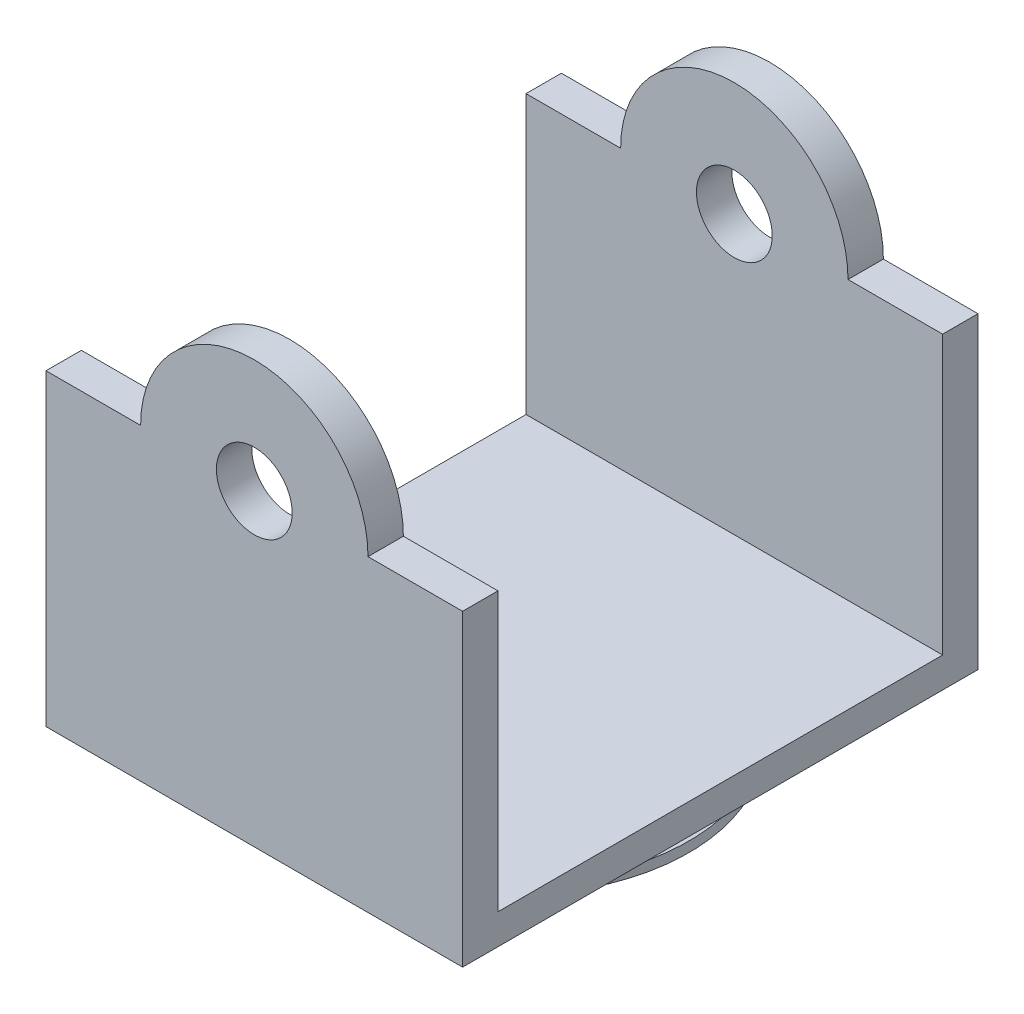
ISO-10303-21;
HEADER;
FILE_DESCRIPTION(('STEP AP214'),'2;1');
FILE_NAME('part.step','',(''),(''),'','','');
FILE_SCHEMA(('AUTOMOTIVE_DESIGN { 1 0 10303 214 1 1 1 1 }'));
ENDSEC;
DATA;
#1=APPLICATION_CONTEXT('core data for automotive mechanical design processes');
#2=APPLICATION_PROTOCOL_DEFINITION('international standard','automotive_design',2000,#1);
#3=PRODUCT_CONTEXT('',#1,'mechanical');
#4=PRODUCT('Part','Part','',(#3));
#5=PRODUCT_RELATED_PRODUCT_CATEGORY('part','',(#4));
#6=PRODUCT_DEFINITION_FORMATION('','',#4);
#7=PRODUCT_DEFINITION_CONTEXT('part definition',#1,'design');
#8=PRODUCT_DEFINITION('design','',#6,#7);
#9=PRODUCT_DEFINITION_SHAPE('','',#8);
#10=(LENGTH_UNIT() NAMED_UNIT(*) SI_UNIT(.MILLI.,.METRE.));
#11=(NAMED_UNIT(*) PLANE_ANGLE_UNIT() SI_UNIT($,.RADIAN.));
#12=(NAMED_UNIT(*) SI_UNIT($,.STERADIAN.) SOLID_ANGLE_UNIT());
#13=UNCERTAINTY_MEASURE_WITH_UNIT(LENGTH_MEASURE(1.E-05),#10,'distance_accuracy_value','');
#14=(GEOMETRIC_REPRESENTATION_CONTEXT(3) GLOBAL_UNCERTAINTY_ASSIGNED_CONTEXT((#13)) GLOBAL_UNIT_ASSIGNED_CONTEXT((#10,
#11,#12)) REPRESENTATION_CONTEXT('',''));
#15=CARTESIAN_POINT('',(0.,0.,0.));
#16=DIRECTION('',(0.,0.,1.));
#17=DIRECTION('',(1.,0.,0.));
#18=AXIS2_PLACEMENT_3D('',#15,#16,#17);
#19=CARTESIAN_POINT('',(0.,55.,0.));
#20=DIRECTION('',(0.,1.,0.));
#21=DIRECTION('',(0.,0.,1.));
#22=AXIS2_PLACEMENT_3D('',#19,#20,#21);
#23=PLANE('',#22);
#24=DIRECTION('',(0.,0.,-1.));
#25=VECTOR('',#24,1.);
#26=CARTESIAN_POINT('',(22.5,55.,51.));
#27=LINE('',#26,#25);
#28=CARTESIAN_POINT('',(22.5,55.,51.));
#29=VERTEX_POINT('',#28);
#30=CARTESIAN_POINT('',(22.5,55.,44.));
#31=VERTEX_POINT('',#30);
#32=EDGE_CURVE('E58',#29,#31,#27,.T.);
#33=ORIENTED_EDGE('',*,*,#32,.F.);
#34=DIRECTION('',(1.,0.,0.));
#35=VECTOR('',#34,1.);
#36=CARTESIAN_POINT('',(-41.225,55.,51.));
#37=LINE('',#36,#35);
#38=CARTESIAN_POINT('',(41.225,55.,51.));
#39=VERTEX_POINT('',#38);
#40=EDGE_CURVE('E244',#29,#39,#37,.T.);
#41=ORIENTED_EDGE('',*,*,#40,.T.);
#42=DIRECTION('',(0.,0.,-1.));
#43=VECTOR('',#42,1.);
#44=CARTESIAN_POINT('',(41.225,55.,51.));
#45=LINE('',#44,#43);
#46=CARTESIAN_POINT('',(41.225,55.,44.));
#47=VERTEX_POINT('',#46);
#48=EDGE_CURVE('E247',#39,#47,#45,.T.);
#49=ORIENTED_EDGE('',*,*,#48,.T.);
#50=DIRECTION('',(-1.,0.,0.));
#51=VECTOR('',#50,1.);
#52=CARTESIAN_POINT('',(41.225,55.,44.));
#53=LINE('',#52,#51);
#54=EDGE_CURVE('E140',#47,#31,#53,.T.);
#55=ORIENTED_EDGE('',*,*,#54,.T.);
#56=EDGE_LOOP('',(#33,#41,#49,#55));
#57=FACE_BOUND('',#56,.T.);
#58=ADVANCED_FACE('F41',(#57),#23,.T.);
#59=CARTESIAN_POINT('',(0.,55.,0.));
#60=DIRECTION('',(0.,-1.,0.));
#61=DIRECTION('',(0.,0.,-1.));
#62=AXIS2_PLACEMENT_3D('',#59,#60,#61);
#63=PLANE('',#62);
#64=DIRECTION('',(-1.,0.,0.));
#65=VECTOR('',#64,1.);
#66=CARTESIAN_POINT('',(-41.225,55.,-51.));
#67=LINE('',#66,#65);
#68=CARTESIAN_POINT('',(41.225,55.,-51.));
#69=VERTEX_POINT('',#68);
#70=CARTESIAN_POINT('',(22.5,55.,-51.));
#71=VERTEX_POINT('',#70);
#72=EDGE_CURVE('E190',#69,#71,#67,.T.);
#73=ORIENTED_EDGE('',*,*,#72,.T.);
#74=DIRECTION('',(0.,0.,1.));
#75=VECTOR('',#74,1.);
#76=CARTESIAN_POINT('',(22.5,55.,-51.));
#77=LINE('',#76,#75);
#78=CARTESIAN_POINT('',(22.5,55.,-44.));
#79=VERTEX_POINT('',#78);
#80=EDGE_CURVE('E173',#71,#79,#77,.T.);
#81=ORIENTED_EDGE('',*,*,#80,.T.);
#82=DIRECTION('',(1.,0.,0.));
#83=VECTOR('',#82,1.);
#84=CARTESIAN_POINT('',(41.225,55.,-44.));
#85=LINE('',#84,#83);
#86=CARTESIAN_POINT('',(41.225,55.,-44.));
#87=VERTEX_POINT('',#86);
#88=EDGE_CURVE('E185',#79,#87,#85,.T.);
#89=ORIENTED_EDGE('',*,*,#88,.T.);
#90=DIRECTION('',(0.,0.,-1.));
#91=VECTOR('',#90,1.);
#92=CARTESIAN_POINT('',(41.225,55.,-51.));
#93=LINE('',#92,#91);
#94=EDGE_CURVE('E184',#87,#69,#93,.T.);
#95=ORIENTED_EDGE('',*,*,#94,.T.);
#96=EDGE_LOOP('',(#73,#81,#89,#95));
#97=FACE_BOUND('',#96,.T.);
#98=ADVANCED_FACE('F293',(#97),#63,.F.);
#99=CARTESIAN_POINT('',(41.225,55.,44.));
#100=DIRECTION('',(0.,0.,1.));
#101=DIRECTION('',(1.,0.,0.));
#102=AXIS2_PLACEMENT_3D('',#99,#100,#101);
#103=PLANE('',#102);
#104=CARTESIAN_POINT('',(0.,55.,44.));
#105=DIRECTION('',(0.,0.,-1.));
#106=DIRECTION('',(-1.,0.,0.));
#107=AXIS2_PLACEMENT_3D('',#104,#105,#106);
#108=CIRCLE('',#107,7.5);
#109=CARTESIAN_POINT('',(-7.49999999999999,55.,44.));
#110=VERTEX_POINT('',#109);
#111=EDGE_CURVE('E327',#110,#110,#108,.T.);
#112=ORIENTED_EDGE('',*,*,#111,.F.);
#113=EDGE_LOOP('',(#112));
#114=FACE_BOUND('',#113,.T.);
#115=DIRECTION('',(1.,0.,0.));
#116=VECTOR('',#115,1.);
#117=CARTESIAN_POINT('',(-41.225,0.,44.));
#118=LINE('',#117,#116);
#119=CARTESIAN_POINT('',(-41.225,0.,44.));
#120=VERTEX_POINT('',#119);
#121=CARTESIAN_POINT('',(41.225,0.,44.));
#122=VERTEX_POINT('',#121);
#123=EDGE_CURVE('E222',#120,#122,#118,.T.);
#124=ORIENTED_EDGE('',*,*,#123,.F.);
#125=DIRECTION('',(0.,-1.,0.));
#126=VECTOR('',#125,1.);
#127=CARTESIAN_POINT('',(-41.225,55.,44.));
#128=LINE('',#127,#126);
#129=CARTESIAN_POINT('',(-41.225,55.,44.));
#130=VERTEX_POINT('',#129);
#131=EDGE_CURVE('E45',#130,#120,#128,.T.);
#132=ORIENTED_EDGE('',*,*,#131,.F.);
#133=CARTESIAN_POINT('',(-22.5,55.,44.));
#134=VERTEX_POINT('',#133);
#135=EDGE_CURVE('E133',#134,#130,#53,.T.);
#136=ORIENTED_EDGE('',*,*,#135,.F.);
#137=CARTESIAN_POINT('',(0.,55.,44.));
#138=DIRECTION('',(0.,0.,-1.));
#139=DIRECTION('',(-1.,0.,0.));
#140=AXIS2_PLACEMENT_3D('',#137,#138,#139);
#141=CIRCLE('',#140,22.5);
#142=EDGE_CURVE('E136',#134,#31,#141,.T.);
#143=ORIENTED_EDGE('',*,*,#142,.T.);
#144=ORIENTED_EDGE('',*,*,#54,.F.);
#145=DIRECTION('',(0.,-1.,0.));
#146=VECTOR('',#145,1.);
#147=CARTESIAN_POINT('',(41.225,55.,44.));
#148=LINE('',#147,#146);
#149=EDGE_CURVE('E250',#47,#122,#148,.T.);
#150=ORIENTED_EDGE('',*,*,#149,.T.);
#151=EDGE_LOOP('',(#124,#132,#136,#143,#144,#150));
#152=FACE_BOUND('',#151,.T.);
#153=ADVANCED_FACE('F43',(#114,#152),#103,.F.);
#154=CARTESIAN_POINT('',(-41.225,55.,44.));
#155=DIRECTION('',(1.,0.,0.));
#156=DIRECTION('',(0.,0.,-1.));
#157=AXIS2_PLACEMENT_3D('',#154,#155,#156);
#158=PLANE('',#157);
#159=ORIENTED_EDGE('',*,*,#131,.T.);
#160=DIRECTION('',(0.,0.,1.));
#161=VECTOR('',#160,1.);
#162=CARTESIAN_POINT('',(-41.225,0.,-44.));
#163=LINE('',#162,#161);
#164=CARTESIAN_POINT('',(-41.225,0.,-44.));
#165=VERTEX_POINT('',#164);
#166=EDGE_CURVE('E226',#165,#120,#163,.T.);
#167=ORIENTED_EDGE('',*,*,#166,.F.);
#168=DIRECTION('',(0.,-1.,0.));
#169=VECTOR('',#168,1.);
#170=CARTESIAN_POINT('',(-41.225,55.,-44.));
#171=LINE('',#170,#169);
#172=CARTESIAN_POINT('',(-41.225,55.,-44.));
#173=VERTEX_POINT('',#172);
#174=EDGE_CURVE('E196',#173,#165,#171,.T.);
#175=ORIENTED_EDGE('',*,*,#174,.F.);
#176=DIRECTION('',(0.,0.,1.));
#177=VECTOR('',#176,1.);
#178=CARTESIAN_POINT('',(-41.225,55.,-44.));
#179=LINE('',#178,#177);
#180=CARTESIAN_POINT('',(-41.225,55.,-51.));
#181=VERTEX_POINT('',#180);
#182=EDGE_CURVE('E193',#181,#173,#179,.T.);
#183=ORIENTED_EDGE('',*,*,#182,.F.);
#184=DIRECTION('',(0.,1.,0.));
#185=VECTOR('',#184,1.);
#186=CARTESIAN_POINT('',(-41.225,-6.,-51.));
#187=LINE('',#186,#185);
#188=CARTESIAN_POINT('',(-41.225,-6.,-51.));
#189=VERTEX_POINT('',#188);
#190=EDGE_CURVE('E214',#189,#181,#187,.T.);
#191=ORIENTED_EDGE('',*,*,#190,.F.);
#192=DIRECTION('',(0.,0.,1.));
#193=VECTOR('',#192,1.);
#194=CARTESIAN_POINT('',(-41.225,-6.,44.));
#195=LINE('',#194,#193);
#196=CARTESIAN_POINT('',(-41.225,-6.,51.));
#197=VERTEX_POINT('',#196);
#198=EDGE_CURVE('E230',#189,#197,#195,.T.);
#199=ORIENTED_EDGE('',*,*,#198,.T.);
#200=DIRECTION('',(0.,-1.,0.));
#201=VECTOR('',#200,1.);
#202=CARTESIAN_POINT('',(-41.225,55.,51.));
#203=LINE('',#202,#201);
#204=CARTESIAN_POINT('',(-41.225,55.,51.));
#205=VERTEX_POINT('',#204);
#206=EDGE_CURVE('E255',#205,#197,#203,.T.);
#207=ORIENTED_EDGE('',*,*,#206,.F.);
#208=DIRECTION('',(0.,0.,1.));
#209=VECTOR('',#208,1.);
#210=CARTESIAN_POINT('',(-41.225,55.,44.));
#211=LINE('',#210,#209);
#212=EDGE_CURVE('E241',#130,#205,#211,.T.);
#213=ORIENTED_EDGE('',*,*,#212,.F.);
#214=EDGE_LOOP('',(#159,#167,#175,#183,#191,#199,#207,#213));
#215=FACE_BOUND('',#214,.T.);
#216=ADVANCED_FACE('F263',(#215),#158,.F.);
#217=CARTESIAN_POINT('',(-41.225,55.,51.));
#218=DIRECTION('',(0.,0.,-1.));
#219=DIRECTION('',(-1.,0.,0.));
#220=AXIS2_PLACEMENT_3D('',#217,#218,#219);
#221=PLANE('',#220);
#222=CARTESIAN_POINT('',(0.,55.,51.));
#223=DIRECTION('',(0.,0.,-1.));
#224=DIRECTION('',(-1.,0.,0.));
#225=AXIS2_PLACEMENT_3D('',#222,#223,#224);
#226=CIRCLE('',#225,7.5);
#227=CARTESIAN_POINT('',(-7.49999999999999,55.,51.));
#228=VERTEX_POINT('',#227);
#229=EDGE_CURVE('E330',#228,#228,#226,.F.);
#230=ORIENTED_EDGE('',*,*,#229,.F.);
#231=EDGE_LOOP('',(#230));
#232=FACE_BOUND('',#231,.T.);
#233=ORIENTED_EDGE('',*,*,#206,.T.);
#234=DIRECTION('',(1.,0.,0.));
#235=VECTOR('',#234,1.);
#236=CARTESIAN_POINT('',(-41.225,-6.,51.));
#237=LINE('',#236,#235);
#238=CARTESIAN_POINT('',(41.225,-6.,51.));
#239=VERTEX_POINT('',#238);
#240=EDGE_CURVE('E234',#197,#239,#237,.T.);
#241=ORIENTED_EDGE('',*,*,#240,.T.);
#242=DIRECTION('',(0.,-1.,0.));
#243=VECTOR('',#242,1.);
#244=CARTESIAN_POINT('',(41.225,55.,51.));
#245=LINE('',#244,#243);
#246=EDGE_CURVE('E253',#39,#239,#245,.T.);
#247=ORIENTED_EDGE('',*,*,#246,.F.);
#248=ORIENTED_EDGE('',*,*,#40,.F.);
#249=CARTESIAN_POINT('',(0.,55.,51.));
#250=DIRECTION('',(0.,0.,-1.));
#251=DIRECTION('',(-1.,0.,0.));
#252=AXIS2_PLACEMENT_3D('',#249,#250,#251);
#253=CIRCLE('',#252,22.5);
#254=CARTESIAN_POINT('',(-22.5,55.,51.));
#255=VERTEX_POINT('',#254);
#256=EDGE_CURVE('E153',#255,#29,#253,.T.);
#257=ORIENTED_EDGE('',*,*,#256,.F.);
#258=EDGE_CURVE('E66',#205,#255,#37,.T.);
#259=ORIENTED_EDGE('',*,*,#258,.F.);
#260=EDGE_LOOP('',(#233,#241,#247,#248,#257,#259));
#261=FACE_BOUND('',#260,.T.);
#262=ADVANCED_FACE('F286',(#232,#261),#221,.F.);
#263=CARTESIAN_POINT('',(41.225,55.,51.));
#264=DIRECTION('',(-1.,0.,0.));
#265=DIRECTION('',(0.,0.,1.));
#266=AXIS2_PLACEMENT_3D('',#263,#264,#265);
#267=PLANE('',#266);
#268=ORIENTED_EDGE('',*,*,#246,.T.);
#269=DIRECTION('',(0.,0.,-1.));
#270=VECTOR('',#269,1.);
#271=CARTESIAN_POINT('',(41.225,-6.,51.));
#272=LINE('',#271,#270);
#273=CARTESIAN_POINT('',(41.225,-6.,-51.));
#274=VERTEX_POINT('',#273);
#275=EDGE_CURVE('E141',#239,#274,#272,.T.);
#276=ORIENTED_EDGE('',*,*,#275,.T.);
#277=DIRECTION('',(0.,1.,0.));
#278=VECTOR('',#277,1.);
#279=CARTESIAN_POINT('',(41.225,-6.,-51.));
#280=LINE('',#279,#278);
#281=EDGE_CURVE('E211',#274,#69,#280,.T.);
#282=ORIENTED_EDGE('',*,*,#281,.T.);
#283=ORIENTED_EDGE('',*,*,#94,.F.);
#284=DIRECTION('',(0.,-1.,0.));
#285=VECTOR('',#284,1.);
#286=CARTESIAN_POINT('',(41.225,55.,-44.));
#287=LINE('',#286,#285);
#288=CARTESIAN_POINT('',(41.225,0.,-44.));
#289=VERTEX_POINT('',#288);
#290=EDGE_CURVE('E203',#87,#289,#287,.T.);
#291=ORIENTED_EDGE('',*,*,#290,.T.);
#292=DIRECTION('',(0.,0.,1.));
#293=VECTOR('',#292,1.);
#294=CARTESIAN_POINT('',(41.225,0.,-44.));
#295=LINE('',#294,#293);
#296=EDGE_CURVE('E218',#289,#122,#295,.T.);
#297=ORIENTED_EDGE('',*,*,#296,.T.);
#298=ORIENTED_EDGE('',*,*,#149,.F.);
#299=ORIENTED_EDGE('',*,*,#48,.F.);
#300=EDGE_LOOP('',(#268,#276,#282,#283,#291,#297,#298,#299));
#301=FACE_BOUND('',#300,.T.);
#302=ADVANCED_FACE('F297',(#301),#267,.F.);
#303=DIRECTION('',(0.,0.,-1.));
#304=VECTOR('',#303,1.);
#305=CARTESIAN_POINT('',(-22.5,55.,51.));
#306=LINE('',#305,#304);
#307=EDGE_CURVE('E143',#255,#134,#306,.T.);
#308=ORIENTED_EDGE('',*,*,#307,.T.);
#309=ORIENTED_EDGE('',*,*,#135,.T.);
#310=ORIENTED_EDGE('',*,*,#212,.T.);
#311=ORIENTED_EDGE('',*,*,#258,.T.);
#312=EDGE_LOOP('',(#308,#309,#310,#311));
#313=FACE_BOUND('',#312,.T.);
#314=ADVANCED_FACE('F144',(#313),#23,.T.);
#315=CARTESIAN_POINT('',(0.,-6.,0.));
#316=DIRECTION('',(0.,1.,0.));
#317=DIRECTION('',(0.,0.,1.));
#318=AXIS2_PLACEMENT_3D('',#315,#316,#317);
#319=PLANE('',#318);
#320=CARTESIAN_POINT('',(0.,-6.,0.));
#321=DIRECTION('',(0.,-1.,0.));
#322=DIRECTION('',(0.,0.,-1.));
#323=AXIS2_PLACEMENT_3D('',#320,#321,#322);
#324=CIRCLE('',#323,32.5);
#325=CARTESIAN_POINT('',(0.,-6.,-32.5));
#326=VERTEX_POINT('',#325);
#327=EDGE_CURVE('E11',#326,#326,#324,.T.);
#328=ORIENTED_EDGE('',*,*,#327,.F.);
#329=EDGE_LOOP('',(#328));
#330=FACE_BOUND('',#329,.T.);
#331=ORIENTED_EDGE('',*,*,#198,.F.);
#332=DIRECTION('',(1.,0.,0.));
#333=VECTOR('',#332,1.);
#334=CARTESIAN_POINT('',(-41.225,-6.,-51.));
#335=LINE('',#334,#333);
#336=EDGE_CURVE('E207',#189,#274,#335,.T.);
#337=ORIENTED_EDGE('',*,*,#336,.T.);
#338=ORIENTED_EDGE('',*,*,#275,.F.);
#339=ORIENTED_EDGE('',*,*,#240,.F.);
#340=EDGE_LOOP('',(#331,#337,#338,#339));
#341=FACE_BOUND('',#340,.T.);
#342=ADVANCED_FACE('F285',(#330,#341),#319,.F.);
#343=CARTESIAN_POINT('',(0.,0.,0.));
#344=DIRECTION('',(0.,-1.,0.));
#345=DIRECTION('',(0.,0.,-1.));
#346=AXIS2_PLACEMENT_3D('',#343,#344,#345);
#347=PLANE('',#346);
#348=DIRECTION('',(1.,0.,0.));
#349=VECTOR('',#348,1.);
#350=CARTESIAN_POINT('',(41.225,0.,-44.));
#351=LINE('',#350,#349);
#352=EDGE_CURVE('E177',#165,#289,#351,.T.);
#353=ORIENTED_EDGE('',*,*,#352,.F.);
#354=ORIENTED_EDGE('',*,*,#166,.T.);
#355=ORIENTED_EDGE('',*,*,#123,.T.);
#356=ORIENTED_EDGE('',*,*,#296,.F.);
#357=EDGE_LOOP('',(#353,#354,#355,#356));
#358=FACE_BOUND('',#357,.T.);
#359=ADVANCED_FACE('F266',(#358),#347,.F.);
#360=CARTESIAN_POINT('',(-41.225,-6.,-51.));
#361=DIRECTION('',(0.,0.,1.));
#362=DIRECTION('',(1.,0.,0.));
#363=AXIS2_PLACEMENT_3D('',#360,#361,#362);
#364=PLANE('',#363);
#365=CARTESIAN_POINT('',(0.,55.,-51.));
#366=DIRECTION('',(0.,0.,1.));
#367=DIRECTION('',(1.,0.,0.));
#368=AXIS2_PLACEMENT_3D('',#365,#366,#367);
#369=CIRCLE('',#368,7.5);
#370=CARTESIAN_POINT('',(7.49999999999998,55.,-51.));
#371=VERTEX_POINT('',#370);
#372=EDGE_CURVE('E340',#371,#371,#369,.F.);
#373=ORIENTED_EDGE('',*,*,#372,.F.);
#374=EDGE_LOOP('',(#373));
#375=FACE_BOUND('',#374,.T.);
#376=ORIENTED_EDGE('',*,*,#190,.T.);
#377=CARTESIAN_POINT('',(-22.5,55.,-51.));
#378=VERTEX_POINT('',#377);
#379=EDGE_CURVE('E189',#378,#181,#67,.T.);
#380=ORIENTED_EDGE('',*,*,#379,.F.);
#381=CARTESIAN_POINT('',(0.,55.,-51.));
#382=DIRECTION('',(0.,0.,1.));
#383=DIRECTION('',(1.,0.,0.));
#384=AXIS2_PLACEMENT_3D('',#381,#382,#383);
#385=CIRCLE('',#384,22.5);
#386=EDGE_CURVE('E165',#71,#378,#385,.T.);
#387=ORIENTED_EDGE('',*,*,#386,.F.);
#388=ORIENTED_EDGE('',*,*,#72,.F.);
#389=ORIENTED_EDGE('',*,*,#281,.F.);
#390=ORIENTED_EDGE('',*,*,#336,.F.);
#391=EDGE_LOOP('',(#376,#380,#387,#388,#389,#390));
#392=FACE_BOUND('',#391,.T.);
#393=ADVANCED_FACE('F280',(#375,#392),#364,.F.);
#394=CARTESIAN_POINT('',(41.225,55.,-44.));
#395=DIRECTION('',(0.,0.,-1.));
#396=DIRECTION('',(-1.,0.,0.));
#397=AXIS2_PLACEMENT_3D('',#394,#395,#396);
#398=PLANE('',#397);
#399=CARTESIAN_POINT('',(0.,55.,-44.));
#400=DIRECTION('',(0.,0.,1.));
#401=DIRECTION('',(1.,0.,0.));
#402=AXIS2_PLACEMENT_3D('',#399,#400,#401);
#403=CIRCLE('',#402,7.5);
#404=CARTESIAN_POINT('',(7.49999999999998,55.,-44.));
#405=VERTEX_POINT('',#404);
#406=EDGE_CURVE('E334',#405,#405,#403,.T.);
#407=ORIENTED_EDGE('',*,*,#406,.F.);
#408=EDGE_LOOP('',(#407));
#409=FACE_BOUND('',#408,.T.);
#410=ORIENTED_EDGE('',*,*,#352,.T.);
#411=ORIENTED_EDGE('',*,*,#290,.F.);
#412=ORIENTED_EDGE('',*,*,#88,.F.);
#413=CARTESIAN_POINT('',(0.,55.,-44.));
#414=DIRECTION('',(0.,0.,1.));
#415=DIRECTION('',(1.,0.,0.));
#416=AXIS2_PLACEMENT_3D('',#413,#414,#415);
#417=CIRCLE('',#416,22.5);
#418=CARTESIAN_POINT('',(-22.5,55.,-44.));
#419=VERTEX_POINT('',#418);
#420=EDGE_CURVE('E149',#79,#419,#417,.T.);
#421=ORIENTED_EDGE('',*,*,#420,.T.);
#422=EDGE_CURVE('E181',#173,#419,#85,.T.);
#423=ORIENTED_EDGE('',*,*,#422,.F.);
#424=ORIENTED_EDGE('',*,*,#174,.T.);
#425=EDGE_LOOP('',(#410,#411,#412,#421,#423,#424));
#426=FACE_BOUND('',#425,.T.);
#427=ADVANCED_FACE('F269',(#409,#426),#398,.F.);
#428=ORIENTED_EDGE('',*,*,#422,.T.);
#429=DIRECTION('',(0.,0.,1.));
#430=VECTOR('',#429,1.);
#431=CARTESIAN_POINT('',(-22.5,55.,-51.));
#432=LINE('',#431,#430);
#433=EDGE_CURVE('E169',#378,#419,#432,.T.);
#434=ORIENTED_EDGE('',*,*,#433,.F.);
#435=ORIENTED_EDGE('',*,*,#379,.T.);
#436=ORIENTED_EDGE('',*,*,#182,.T.);
#437=EDGE_LOOP('',(#428,#434,#435,#436));
#438=FACE_BOUND('',#437,.T.);
#439=ADVANCED_FACE('F275',(#438),#63,.F.);
#440=CARTESIAN_POINT('',(0.,55.,-51.));
#441=DIRECTION('',(0.,0.,1.));
#442=DIRECTION('',(1.,0.,0.));
#443=AXIS2_PLACEMENT_3D('',#440,#441,#442);
#444=CYLINDRICAL_SURFACE('',#443,22.5);
#445=ORIENTED_EDGE('',*,*,#420,.F.);
#446=ORIENTED_EDGE('',*,*,#80,.F.);
#447=ORIENTED_EDGE('',*,*,#386,.T.);
#448=ORIENTED_EDGE('',*,*,#433,.T.);
#449=EDGE_LOOP('',(#445,#446,#447,#448));
#450=FACE_BOUND('',#449,.T.);
#451=ADVANCED_FACE('F379',(#450),#444,.T.);
#452=CARTESIAN_POINT('',(0.,55.,51.));
#453=DIRECTION('',(0.,0.,-1.));
#454=DIRECTION('',(-1.,0.,0.));
#455=AXIS2_PLACEMENT_3D('',#452,#453,#454);
#456=CYLINDRICAL_SURFACE('',#455,22.5);
#457=ORIENTED_EDGE('',*,*,#142,.F.);
#458=ORIENTED_EDGE('',*,*,#307,.F.);
#459=ORIENTED_EDGE('',*,*,#256,.T.);
#460=ORIENTED_EDGE('',*,*,#32,.T.);
#461=EDGE_LOOP('',(#457,#458,#459,#460));
#462=FACE_BOUND('',#461,.T.);
#463=ADVANCED_FACE('F151',(#462),#456,.T.);
#464=CARTESIAN_POINT('',(0.,-13.,0.));
#465=DIRECTION('',(0.,1.,0.));
#466=DIRECTION('',(0.,0.,1.));
#467=AXIS2_PLACEMENT_3D('',#464,#465,#466);
#468=CYLINDRICAL_SURFACE('',#467,32.5);
#469=CARTESIAN_POINT('',(0.,-13.,0.));
#470=DIRECTION('',(0.,-1.,0.));
#471=DIRECTION('',(0.,0.,-1.));
#472=AXIS2_PLACEMENT_3D('',#469,#470,#471);
#473=CIRCLE('',#472,32.5);
#474=CARTESIAN_POINT('',(0.,-13.,-32.5));
#475=VERTEX_POINT('',#474);
#476=EDGE_CURVE('E154',#475,#475,#473,.T.);
#477=ORIENTED_EDGE('',*,*,#476,.F.);
#478=EDGE_LOOP('',(#477));
#479=FACE_BOUND('',#478,.T.);
#480=ORIENTED_EDGE('',*,*,#327,.T.);
#481=EDGE_LOOP('',(#480));
#482=FACE_BOUND('',#481,.T.);
#483=ADVANCED_FACE('F372',(#479,#482),#468,.T.);
#484=CARTESIAN_POINT('',(0.,-15.,0.));
#485=DIRECTION('',(0.,1.,0.));
#486=DIRECTION('',(0.,0.,1.));
#487=AXIS2_PLACEMENT_3D('',#484,#485,#486);
#488=CYLINDRICAL_SURFACE('',#487,35.);
#489=CARTESIAN_POINT('',(0.,-15.,0.));
#490=DIRECTION('',(0.,-1.,0.));
#491=DIRECTION('',(0.,0.,-1.));
#492=AXIS2_PLACEMENT_3D('',#489,#490,#491);
#493=CIRCLE('',#492,35.);
#494=CARTESIAN_POINT('',(0.,-15.,-35.));
#495=VERTEX_POINT('',#494);
#496=EDGE_CURVE('E160',#495,#495,#493,.T.);
#497=ORIENTED_EDGE('',*,*,#496,.F.);
#498=EDGE_LOOP('',(#497));
#499=FACE_BOUND('',#498,.T.);
#500=CARTESIAN_POINT('',(0.,-13.,0.));
#501=DIRECTION('',(0.,-1.,0.));
#502=DIRECTION('',(0.,0.,-1.));
#503=AXIS2_PLACEMENT_3D('',#500,#501,#502);
#504=CIRCLE('',#503,35.);
#505=CARTESIAN_POINT('',(0.,-13.,-35.));
#506=VERTEX_POINT('',#505);
#507=EDGE_CURVE('E344',#506,#506,#504,.T.);
#508=ORIENTED_EDGE('',*,*,#507,.T.);
#509=EDGE_LOOP('',(#508));
#510=FACE_BOUND('',#509,.T.);
#511=ADVANCED_FACE('F352',(#499,#510),#488,.T.);
#512=CARTESIAN_POINT('',(0.,-15.,0.));
#513=DIRECTION('',(0.,-1.,0.));
#514=DIRECTION('',(0.,0.,-1.));
#515=AXIS2_PLACEMENT_3D('',#512,#513,#514);
#516=PLANE('',#515);
#517=ORIENTED_EDGE('',*,*,#496,.T.);
#518=EDGE_LOOP('',(#517));
#519=FACE_BOUND('',#518,.T.);
#520=ADVANCED_FACE('F357',(#519),#516,.T.);
#521=CARTESIAN_POINT('',(0.,-13.,0.));
#522=DIRECTION('',(0.,-1.,0.));
#523=DIRECTION('',(0.,0.,-1.));
#524=AXIS2_PLACEMENT_3D('',#521,#522,#523);
#525=PLANE('',#524);
#526=ORIENTED_EDGE('',*,*,#476,.T.);
#527=EDGE_LOOP('',(#526));
#528=FACE_BOUND('',#527,.T.);
#529=ORIENTED_EDGE('',*,*,#507,.F.);
#530=EDGE_LOOP('',(#529));
#531=FACE_BOUND('',#530,.T.);
#532=ADVANCED_FACE('F354',(#528,#531),#525,.F.);
#533=CARTESIAN_POINT('',(0.,55.,-72.2132034355964));
#534=DIRECTION('',(0.,0.,1.));
#535=DIRECTION('',(1.,0.,0.));
#536=AXIS2_PLACEMENT_3D('',#533,#534,#535);
#537=CYLINDRICAL_SURFACE('',#536,7.5);
#538=ORIENTED_EDGE('',*,*,#372,.T.);
#539=EDGE_LOOP('',(#538));
#540=FACE_BOUND('',#539,.T.);
#541=ORIENTED_EDGE('',*,*,#406,.T.);
#542=EDGE_LOOP('',(#541));
#543=FACE_BOUND('',#542,.T.);
#544=ADVANCED_FACE('F356',(#540,#543),#537,.F.);
#545=CARTESIAN_POINT('',(0.,55.,72.2132034355964));
#546=DIRECTION('',(0.,0.,-1.));
#547=DIRECTION('',(-1.,0.,0.));
#548=AXIS2_PLACEMENT_3D('',#545,#546,#547);
#549=CYLINDRICAL_SURFACE('',#548,7.5);
#550=ORIENTED_EDGE('',*,*,#229,.T.);
#551=EDGE_LOOP('',(#550));
#552=FACE_BOUND('',#551,.T.);
#553=ORIENTED_EDGE('',*,*,#111,.T.);
#554=EDGE_LOOP('',(#553));
#555=FACE_BOUND('',#554,.T.);
#556=ADVANCED_FACE('F364',(#552,#555),#549,.F.);
#557=CLOSED_SHELL('',(#58,#98,#153,#216,#262,#302,#314,#342,#359,#393,#427,#439,#451,#463,#483,
#511,#520,#532,#544,#556));
#558=MANIFOLD_SOLID_BREP('B2',#557);
#559=ADVANCED_BREP_SHAPE_REPRESENTATION('',(#18,#558),#14);
#560=SHAPE_DEFINITION_REPRESENTATION(#9,#559);
ENDSEC;
END-ISO-10303-21;
